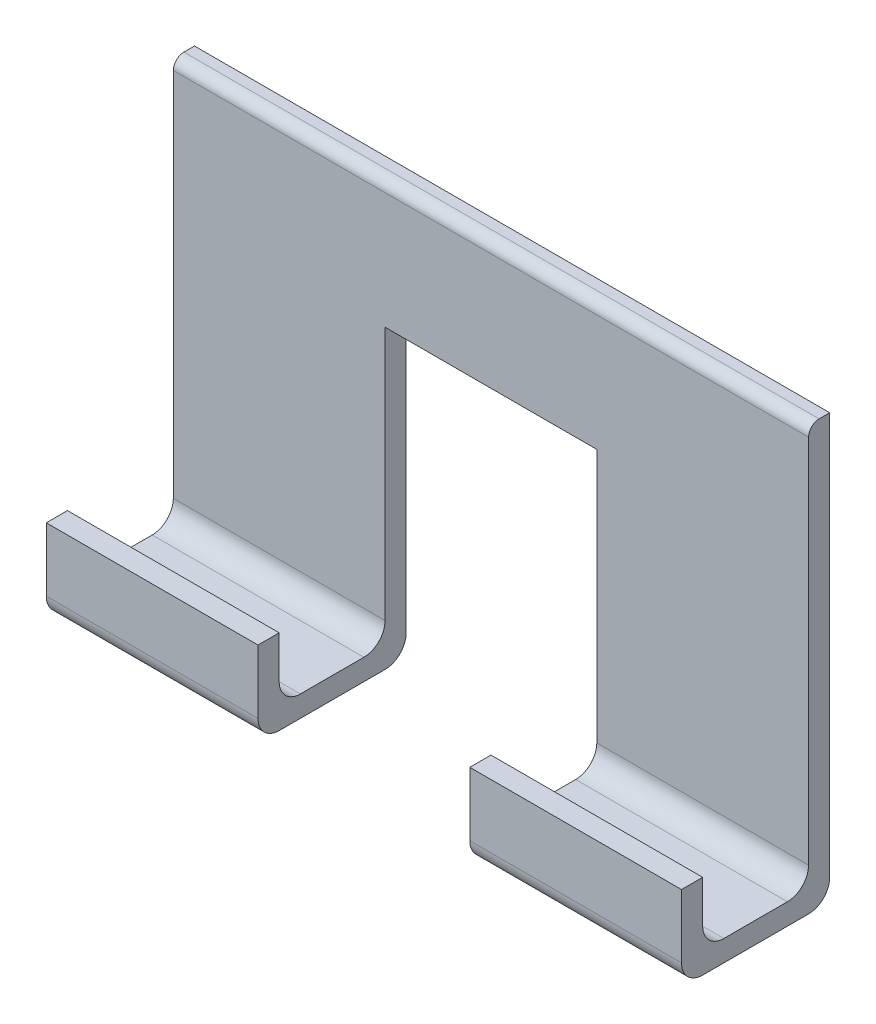
ISO-10303-21;
HEADER;
FILE_DESCRIPTION(('STEP AP214'),'2;1');
FILE_NAME('part.step','',(''),(''),'','','');
FILE_SCHEMA(('AUTOMOTIVE_DESIGN { 1 0 10303 214 1 1 1 1 }'));
ENDSEC;
DATA;
#1=APPLICATION_CONTEXT('core data for automotive mechanical design processes');
#2=APPLICATION_PROTOCOL_DEFINITION('international standard','automotive_design',2000,#1);
#3=PRODUCT_CONTEXT('',#1,'mechanical');
#4=PRODUCT('Part','Part','',(#3));
#5=PRODUCT_RELATED_PRODUCT_CATEGORY('part','',(#4));
#6=PRODUCT_DEFINITION_FORMATION('','',#4);
#7=PRODUCT_DEFINITION_CONTEXT('part definition',#1,'design');
#8=PRODUCT_DEFINITION('design','',#6,#7);
#9=PRODUCT_DEFINITION_SHAPE('','',#8);
#10=(LENGTH_UNIT() NAMED_UNIT(*) SI_UNIT(.MILLI.,.METRE.));
#11=(NAMED_UNIT(*) PLANE_ANGLE_UNIT() SI_UNIT($,.RADIAN.));
#12=(NAMED_UNIT(*) SI_UNIT($,.STERADIAN.) SOLID_ANGLE_UNIT());
#13=UNCERTAINTY_MEASURE_WITH_UNIT(LENGTH_MEASURE(1.E-05),#10,'distance_accuracy_value','');
#14=(GEOMETRIC_REPRESENTATION_CONTEXT(3) GLOBAL_UNCERTAINTY_ASSIGNED_CONTEXT((#13)) GLOBAL_UNIT_ASSIGNED_CONTEXT((#10,
#11,#12)) REPRESENTATION_CONTEXT('',''));
#15=CARTESIAN_POINT('',(0.,0.,0.));
#16=DIRECTION('',(0.,0.,1.));
#17=DIRECTION('',(1.,0.,0.));
#18=AXIS2_PLACEMENT_3D('',#15,#16,#17);
#19=CARTESIAN_POINT('',(150.,10.,60.));
#20=DIRECTION('',(0.,-1.,0.));
#21=DIRECTION('',(0.,0.,-1.));
#22=AXIS2_PLACEMENT_3D('',#19,#20,#21);
#23=PLANE('',#22);
#24=DIRECTION('',(0.,0.,-1.));
#25=VECTOR('',#24,1.);
#26=CARTESIAN_POINT('',(-50.,10.,60.));
#27=LINE('',#26,#25);
#28=CARTESIAN_POINT('',(-50.,10.,50.));
#29=VERTEX_POINT('',#28);
#30=CARTESIAN_POINT('',(-50.,10.,20.));
#31=VERTEX_POINT('',#30);
#32=EDGE_CURVE('E275',#29,#31,#27,.T.);
#33=ORIENTED_EDGE('',*,*,#32,.T.);
#34=DIRECTION('',(-1.,0.,0.));
#35=VECTOR('',#34,1.);
#36=CARTESIAN_POINT('',(-150.,10.,20.));
#37=LINE('',#36,#35);
#38=CARTESIAN_POINT('',(-150.,10.,20.));
#39=VERTEX_POINT('',#38);
#40=EDGE_CURVE('E429',#31,#39,#37,.T.);
#41=ORIENTED_EDGE('',*,*,#40,.T.);
#42=DIRECTION('',(0.,0.,1.));
#43=VECTOR('',#42,1.);
#44=CARTESIAN_POINT('',(-150.,10.,60.));
#45=LINE('',#44,#43);
#46=CARTESIAN_POINT('',(-150.,10.,50.));
#47=VERTEX_POINT('',#46);
#48=EDGE_CURVE('E320',#39,#47,#45,.T.);
#49=ORIENTED_EDGE('',*,*,#48,.T.);
#50=DIRECTION('',(-1.,0.,0.));
#51=VECTOR('',#50,1.);
#52=CARTESIAN_POINT('',(-50.,10.,50.));
#53=LINE('',#52,#51);
#54=EDGE_CURVE('E426',#47,#29,#53,.F.);
#55=ORIENTED_EDGE('',*,*,#54,.T.);
#56=EDGE_LOOP('',(#33,#41,#49,#55));
#57=FACE_BOUND('',#56,.T.);
#58=ADVANCED_FACE('F45',(#57),#23,.F.);
#59=CARTESIAN_POINT('',(150.,10.,60.));
#60=DIRECTION('',(0.,0.,1.));
#61=DIRECTION('',(0.,-1.,0.));
#62=AXIS2_PLACEMENT_3D('',#59,#60,#61);
#63=PLANE('',#62);
#64=DIRECTION('',(0.,-1.,0.));
#65=VECTOR('',#64,1.);
#66=CARTESIAN_POINT('',(-50.,10.,60.));
#67=LINE('',#66,#65);
#68=CARTESIAN_POINT('',(-50.,40.,60.));
#69=VERTEX_POINT('',#68);
#70=CARTESIAN_POINT('',(-50.,20.,60.));
#71=VERTEX_POINT('',#70);
#72=EDGE_CURVE('E271',#69,#71,#67,.T.);
#73=ORIENTED_EDGE('',*,*,#72,.T.);
#74=DIRECTION('',(-1.,0.,0.));
#75=VECTOR('',#74,1.);
#76=CARTESIAN_POINT('',(-150.,20.,60.));
#77=LINE('',#76,#75);
#78=CARTESIAN_POINT('',(-150.,20.,60.));
#79=VERTEX_POINT('',#78);
#80=EDGE_CURVE('E437',#71,#79,#77,.T.);
#81=ORIENTED_EDGE('',*,*,#80,.T.);
#82=DIRECTION('',(0.,1.,0.));
#83=VECTOR('',#82,1.);
#84=CARTESIAN_POINT('',(-150.,10.,60.));
#85=LINE('',#84,#83);
#86=CARTESIAN_POINT('',(-150.,40.,60.));
#87=VERTEX_POINT('',#86);
#88=EDGE_CURVE('E324',#79,#87,#85,.T.);
#89=ORIENTED_EDGE('',*,*,#88,.T.);
#90=DIRECTION('',(-1.,0.,0.));
#91=VECTOR('',#90,1.);
#92=CARTESIAN_POINT('',(150.,40.,60.));
#93=LINE('',#92,#91);
#94=EDGE_CURVE('E342',#69,#87,#93,.T.);
#95=ORIENTED_EDGE('',*,*,#94,.F.);
#96=EDGE_LOOP('',(#73,#81,#89,#95));
#97=FACE_BOUND('',#96,.T.);
#98=ADVANCED_FACE('F567',(#97),#63,.F.);
#99=CARTESIAN_POINT('',(150.,40.,70.));
#100=DIRECTION('',(0.,-1.,0.));
#101=DIRECTION('',(0.,0.,-1.));
#102=AXIS2_PLACEMENT_3D('',#99,#100,#101);
#103=PLANE('',#102);
#104=DIRECTION('',(-1.,0.,0.));
#105=VECTOR('',#104,1.);
#106=CARTESIAN_POINT('',(150.,40.,70.));
#107=LINE('',#106,#105);
#108=CARTESIAN_POINT('',(-50.,40.,70.));
#109=VERTEX_POINT('',#108);
#110=CARTESIAN_POINT('',(-150.,40.,70.));
#111=VERTEX_POINT('',#110);
#112=EDGE_CURVE('E311',#109,#111,#107,.T.);
#113=ORIENTED_EDGE('',*,*,#112,.F.);
#114=DIRECTION('',(0.,0.,-1.));
#115=VECTOR('',#114,1.);
#116=CARTESIAN_POINT('',(-50.,40.,70.));
#117=LINE('',#116,#115);
#118=EDGE_CURVE('E267',#109,#69,#117,.T.);
#119=ORIENTED_EDGE('',*,*,#118,.T.);
#120=ORIENTED_EDGE('',*,*,#94,.T.);
#121=DIRECTION('',(0.,0.,1.));
#122=VECTOR('',#121,1.);
#123=CARTESIAN_POINT('',(-150.,40.,70.));
#124=LINE('',#123,#122);
#125=EDGE_CURVE('E327',#87,#111,#124,.T.);
#126=ORIENTED_EDGE('',*,*,#125,.T.);
#127=EDGE_LOOP('',(#113,#119,#120,#126));
#128=FACE_BOUND('',#127,.T.);
#129=ADVANCED_FACE('F483',(#128),#103,.F.);
#130=CARTESIAN_POINT('',(150.,40.,70.));
#131=DIRECTION('',(0.,0.,-1.));
#132=DIRECTION('',(-1.,0.,0.));
#133=AXIS2_PLACEMENT_3D('',#130,#131,#132);
#134=PLANE('',#133);
#135=DIRECTION('',(0.,-1.,0.));
#136=VECTOR('',#135,1.);
#137=CARTESIAN_POINT('',(-150.,40.,70.));
#138=LINE('',#137,#136);
#139=CARTESIAN_POINT('',(-150.,10.,70.));
#140=VERTEX_POINT('',#139);
#141=EDGE_CURVE('E331',#111,#140,#138,.T.);
#142=ORIENTED_EDGE('',*,*,#141,.T.);
#143=DIRECTION('',(-1.,0.,0.));
#144=VECTOR('',#143,1.);
#145=CARTESIAN_POINT('',(150.,10.,70.));
#146=LINE('',#145,#144);
#147=CARTESIAN_POINT('',(-50.,10.,70.));
#148=VERTEX_POINT('',#147);
#149=EDGE_CURVE('E406',#140,#148,#146,.F.);
#150=ORIENTED_EDGE('',*,*,#149,.T.);
#151=DIRECTION('',(0.,-1.,0.));
#152=VECTOR('',#151,1.);
#153=CARTESIAN_POINT('',(-50.,-140.,70.));
#154=LINE('',#153,#152);
#155=EDGE_CURVE('E245',#109,#148,#154,.T.);
#156=ORIENTED_EDGE('',*,*,#155,.F.);
#157=ORIENTED_EDGE('',*,*,#112,.T.);
#158=EDGE_LOOP('',(#142,#150,#156,#157));
#159=FACE_BOUND('',#158,.T.);
#160=ADVANCED_FACE('F478',(#159),#134,.F.);
#161=CARTESIAN_POINT('',(150.,0.,0.));
#162=DIRECTION('',(0.,1.,0.));
#163=DIRECTION('',(0.,0.,1.));
#164=AXIS2_PLACEMENT_3D('',#161,#162,#163);
#165=PLANE('',#164);
#166=DIRECTION('',(0.,0.,-1.));
#167=VECTOR('',#166,1.);
#168=CARTESIAN_POINT('',(-150.,0.,0.));
#169=LINE('',#168,#167);
#170=CARTESIAN_POINT('',(-150.,0.,60.));
#171=VERTEX_POINT('',#170);
#172=CARTESIAN_POINT('',(-150.,0.,10.));
#173=VERTEX_POINT('',#172);
#174=EDGE_CURVE('E287',#171,#173,#169,.T.);
#175=ORIENTED_EDGE('',*,*,#174,.T.);
#176=DIRECTION('',(-1.,0.,0.));
#177=VECTOR('',#176,1.);
#178=CARTESIAN_POINT('',(150.,0.,10.));
#179=LINE('',#178,#177);
#180=CARTESIAN_POINT('',(-50.,0.,10.));
#181=VERTEX_POINT('',#180);
#182=EDGE_CURVE('E378',#173,#181,#179,.F.);
#183=ORIENTED_EDGE('',*,*,#182,.T.);
#184=DIRECTION('',(0.,0.,1.));
#185=VECTOR('',#184,1.);
#186=CARTESIAN_POINT('',(-50.,0.,0.));
#187=LINE('',#186,#185);
#188=CARTESIAN_POINT('',(-50.,0.,60.));
#189=VERTEX_POINT('',#188);
#190=EDGE_CURVE('E355',#181,#189,#187,.T.);
#191=ORIENTED_EDGE('',*,*,#190,.T.);
#192=DIRECTION('',(-1.,0.,0.));
#193=VECTOR('',#192,1.);
#194=CARTESIAN_POINT('',(150.,0.,60.));
#195=LINE('',#194,#193);
#196=EDGE_CURVE('E374',#189,#171,#195,.T.);
#197=ORIENTED_EDGE('',*,*,#196,.T.);
#198=EDGE_LOOP('',(#175,#183,#191,#197));
#199=FACE_BOUND('',#198,.T.);
#200=ADVANCED_FACE('F493',(#199),#165,.F.);
#201=CARTESIAN_POINT('',(150.,0.,0.));
#202=DIRECTION('',(0.,0.,1.));
#203=DIRECTION('',(1.,0.,0.));
#204=AXIS2_PLACEMENT_3D('',#201,#202,#203);
#205=PLANE('',#204);
#206=DIRECTION('',(0.,-1.,0.));
#207=VECTOR('',#206,1.);
#208=CARTESIAN_POINT('',(-50.,-140.,0.));
#209=LINE('',#208,#207);
#210=CARTESIAN_POINT('',(-50.,140.,0.));
#211=VERTEX_POINT('',#210);
#212=CARTESIAN_POINT('',(-50.,10.,0.));
#213=VERTEX_POINT('',#212);
#214=EDGE_CURVE('E225',#211,#213,#209,.T.);
#215=ORIENTED_EDGE('',*,*,#214,.T.);
#216=DIRECTION('',(-1.,0.,0.));
#217=VECTOR('',#216,1.);
#218=CARTESIAN_POINT('',(150.,10.,0.));
#219=LINE('',#218,#217);
#220=CARTESIAN_POINT('',(-150.,10.,0.));
#221=VERTEX_POINT('',#220);
#222=EDGE_CURVE('E364',#213,#221,#219,.T.);
#223=ORIENTED_EDGE('',*,*,#222,.T.);
#224=DIRECTION('',(0.,1.,0.));
#225=VECTOR('',#224,1.);
#226=CARTESIAN_POINT('',(-150.,0.,0.));
#227=LINE('',#226,#225);
#228=CARTESIAN_POINT('',(-150.,200.,0.));
#229=VERTEX_POINT('',#228);
#230=EDGE_CURVE('E282',#221,#229,#227,.T.);
#231=ORIENTED_EDGE('',*,*,#230,.T.);
#232=DIRECTION('',(-1.,0.,0.));
#233=VECTOR('',#232,1.);
#234=CARTESIAN_POINT('',(150.,200.,0.));
#235=LINE('',#234,#233);
#236=CARTESIAN_POINT('',(150.,200.,0.));
#237=VERTEX_POINT('',#236);
#238=EDGE_CURVE('E347',#237,#229,#235,.T.);
#239=ORIENTED_EDGE('',*,*,#238,.F.);
#240=DIRECTION('',(0.,1.,0.));
#241=VECTOR('',#240,1.);
#242=CARTESIAN_POINT('',(150.,0.,0.));
#243=LINE('',#242,#241);
#244=CARTESIAN_POINT('',(150.,10.,0.));
#245=VERTEX_POINT('',#244);
#246=EDGE_CURVE('E283',#245,#237,#243,.T.);
#247=ORIENTED_EDGE('',*,*,#246,.F.);
#248=DIRECTION('',(-1.,0.,0.));
#249=VECTOR('',#248,1.);
#250=CARTESIAN_POINT('',(150.,10.,0.));
#251=LINE('',#250,#249);
#252=CARTESIAN_POINT('',(50.,10.,0.));
#253=VERTEX_POINT('',#252);
#254=EDGE_CURVE('E222',#245,#253,#251,.T.);
#255=ORIENTED_EDGE('',*,*,#254,.T.);
#256=DIRECTION('',(0.,1.,0.));
#257=VECTOR('',#256,1.);
#258=CARTESIAN_POINT('',(50.,-140.,0.));
#259=LINE('',#258,#257);
#260=CARTESIAN_POINT('',(50.,140.,0.));
#261=VERTEX_POINT('',#260);
#262=EDGE_CURVE('E214',#253,#261,#259,.T.);
#263=ORIENTED_EDGE('',*,*,#262,.T.);
#264=DIRECTION('',(-1.,0.,0.));
#265=VECTOR('',#264,1.);
#266=CARTESIAN_POINT('',(50.,140.,0.));
#267=LINE('',#266,#265);
#268=EDGE_CURVE('E219',#261,#211,#267,.T.);
#269=ORIENTED_EDGE('',*,*,#268,.T.);
#270=EDGE_LOOP('',(#215,#223,#231,#239,#247,#255,#263,#269));
#271=FACE_BOUND('',#270,.T.);
#272=ADVANCED_FACE('F217',(#271),#205,.F.);
#273=CARTESIAN_POINT('',(150.,200.,0.));
#274=DIRECTION('',(0.,-1.,0.));
#275=DIRECTION('',(0.,0.,-1.));
#276=AXIS2_PLACEMENT_3D('',#273,#274,#275);
#277=PLANE('',#276);
#278=DIRECTION('',(0.,0.,1.));
#279=VECTOR('',#278,1.);
#280=CARTESIAN_POINT('',(-150.,200.,0.));
#281=LINE('',#280,#279);
#282=CARTESIAN_POINT('',(-150.,200.,5.));
#283=VERTEX_POINT('',#282);
#284=EDGE_CURVE('E314',#229,#283,#281,.T.);
#285=ORIENTED_EDGE('',*,*,#284,.T.);
#286=DIRECTION('',(-1.,0.,0.));
#287=VECTOR('',#286,1.);
#288=CARTESIAN_POINT('',(150.,200.,5.));
#289=LINE('',#288,#287);
#290=CARTESIAN_POINT('',(150.,200.,5.));
#291=VERTEX_POINT('',#290);
#292=EDGE_CURVE('E54',#283,#291,#289,.F.);
#293=ORIENTED_EDGE('',*,*,#292,.T.);
#294=DIRECTION('',(0.,0.,1.));
#295=VECTOR('',#294,1.);
#296=CARTESIAN_POINT('',(150.,200.,0.));
#297=LINE('',#296,#295);
#298=EDGE_CURVE('E286',#237,#291,#297,.T.);
#299=ORIENTED_EDGE('',*,*,#298,.F.);
#300=ORIENTED_EDGE('',*,*,#238,.T.);
#301=EDGE_LOOP('',(#285,#293,#299,#300));
#302=FACE_BOUND('',#301,.T.);
#303=ADVANCED_FACE('F504',(#302),#277,.F.);
#304=CARTESIAN_POINT('',(150.,200.,10.));
#305=DIRECTION('',(0.,0.,-1.));
#306=DIRECTION('',(0.,1.,0.));
#307=AXIS2_PLACEMENT_3D('',#304,#305,#306);
#308=PLANE('',#307);
#309=DIRECTION('',(0.,-1.,0.));
#310=VECTOR('',#309,1.);
#311=CARTESIAN_POINT('',(150.,200.,10.));
#312=LINE('',#311,#310);
#313=CARTESIAN_POINT('',(150.,195.,10.));
#314=VERTEX_POINT('',#313);
#315=CARTESIAN_POINT('',(150.,20.,9.99999999999999));
#316=VERTEX_POINT('',#315);
#317=EDGE_CURVE('E290',#314,#316,#312,.T.);
#318=ORIENTED_EDGE('',*,*,#317,.F.);
#319=DIRECTION('',(-1.,0.,0.));
#320=VECTOR('',#319,1.);
#321=CARTESIAN_POINT('',(150.,195.,10.));
#322=LINE('',#321,#320);
#323=CARTESIAN_POINT('',(-150.,195.,10.));
#324=VERTEX_POINT('',#323);
#325=EDGE_CURVE('E466',#314,#324,#322,.T.);
#326=ORIENTED_EDGE('',*,*,#325,.T.);
#327=DIRECTION('',(0.,-1.,0.));
#328=VECTOR('',#327,1.);
#329=CARTESIAN_POINT('',(-150.,200.,10.));
#330=LINE('',#329,#328);
#331=CARTESIAN_POINT('',(-150.,20.,9.99999999999999));
#332=VERTEX_POINT('',#331);
#333=EDGE_CURVE('E317',#324,#332,#330,.T.);
#334=ORIENTED_EDGE('',*,*,#333,.T.);
#335=DIRECTION('',(-1.,0.,0.));
#336=VECTOR('',#335,1.);
#337=CARTESIAN_POINT('',(-50.,20.,9.99999999999999));
#338=LINE('',#337,#336);
#339=CARTESIAN_POINT('',(-50.,20.,9.99999999999999));
#340=VERTEX_POINT('',#339);
#341=EDGE_CURVE('E419',#332,#340,#338,.F.);
#342=ORIENTED_EDGE('',*,*,#341,.T.);
#343=DIRECTION('',(0.,1.,0.));
#344=VECTOR('',#343,1.);
#345=CARTESIAN_POINT('',(-50.,200.,10.));
#346=LINE('',#345,#344);
#347=CARTESIAN_POINT('',(-50.,140.,10.));
#348=VERTEX_POINT('',#347);
#349=EDGE_CURVE('E279',#340,#348,#346,.T.);
#350=ORIENTED_EDGE('',*,*,#349,.T.);
#351=DIRECTION('',(1.,0.,0.));
#352=VECTOR('',#351,1.);
#353=CARTESIAN_POINT('',(150.,140.,10.));
#354=LINE('',#353,#352);
#355=CARTESIAN_POINT('',(50.,140.,9.99999999999999));
#356=VERTEX_POINT('',#355);
#357=EDGE_CURVE('E359',#348,#356,#354,.T.);
#358=ORIENTED_EDGE('',*,*,#357,.T.);
#359=DIRECTION('',(0.,-1.,0.));
#360=VECTOR('',#359,1.);
#361=CARTESIAN_POINT('',(50.,200.,10.));
#362=LINE('',#361,#360);
#363=CARTESIAN_POINT('',(50.,20.,9.99999999999999));
#364=VERTEX_POINT('',#363);
#365=EDGE_CURVE('E231',#356,#364,#362,.T.);
#366=ORIENTED_EDGE('',*,*,#365,.T.);
#367=DIRECTION('',(-1.,0.,0.));
#368=VECTOR('',#367,1.);
#369=CARTESIAN_POINT('',(150.,20.,9.99999999999999));
#370=LINE('',#369,#368);
#371=EDGE_CURVE('E422',#364,#316,#370,.F.);
#372=ORIENTED_EDGE('',*,*,#371,.T.);
#373=EDGE_LOOP('',(#318,#326,#334,#342,#350,#358,#366,#372));
#374=FACE_BOUND('',#373,.T.);
#375=ADVANCED_FACE('F550',(#374),#308,.F.);
#376=DIRECTION('',(0.,0.,1.));
#377=VECTOR('',#376,1.);
#378=CARTESIAN_POINT('',(150.,10.,60.));
#379=LINE('',#378,#377);
#380=CARTESIAN_POINT('',(150.,10.,20.));
#381=VERTEX_POINT('',#380);
#382=CARTESIAN_POINT('',(150.,10.,50.));
#383=VERTEX_POINT('',#382);
#384=EDGE_CURVE('E293',#381,#383,#379,.T.);
#385=ORIENTED_EDGE('',*,*,#384,.F.);
#386=DIRECTION('',(-1.,0.,0.));
#387=VECTOR('',#386,1.);
#388=CARTESIAN_POINT('',(50.,10.,20.));
#389=LINE('',#388,#387);
#390=CARTESIAN_POINT('',(50.,10.,20.));
#391=VERTEX_POINT('',#390);
#392=EDGE_CURVE('E415',#381,#391,#389,.T.);
#393=ORIENTED_EDGE('',*,*,#392,.T.);
#394=DIRECTION('',(0.,0.,1.));
#395=VECTOR('',#394,1.);
#396=CARTESIAN_POINT('',(50.,10.,60.));
#397=LINE('',#396,#395);
#398=CARTESIAN_POINT('',(50.,10.,50.));
#399=VERTEX_POINT('',#398);
#400=EDGE_CURVE('E261',#391,#399,#397,.T.);
#401=ORIENTED_EDGE('',*,*,#400,.T.);
#402=DIRECTION('',(-1.,0.,0.));
#403=VECTOR('',#402,1.);
#404=CARTESIAN_POINT('',(150.,10.,50.));
#405=LINE('',#404,#403);
#406=EDGE_CURVE('E412',#399,#383,#405,.F.);
#407=ORIENTED_EDGE('',*,*,#406,.T.);
#408=EDGE_LOOP('',(#385,#393,#401,#407));
#409=FACE_BOUND('',#408,.T.);
#410=ADVANCED_FACE('F541',(#409),#23,.F.);
#411=DIRECTION('',(0.,1.,0.));
#412=VECTOR('',#411,1.);
#413=CARTESIAN_POINT('',(150.,10.,60.));
#414=LINE('',#413,#412);
#415=CARTESIAN_POINT('',(150.,20.,60.));
#416=VERTEX_POINT('',#415);
#417=CARTESIAN_POINT('',(150.,40.,60.));
#418=VERTEX_POINT('',#417);
#419=EDGE_CURVE('E297',#416,#418,#414,.T.);
#420=ORIENTED_EDGE('',*,*,#419,.F.);
#421=DIRECTION('',(-1.,0.,0.));
#422=VECTOR('',#421,1.);
#423=CARTESIAN_POINT('',(50.,20.,60.));
#424=LINE('',#423,#422);
#425=CARTESIAN_POINT('',(50.,20.,60.));
#426=VERTEX_POINT('',#425);
#427=EDGE_CURVE('E433',#416,#426,#424,.T.);
#428=ORIENTED_EDGE('',*,*,#427,.T.);
#429=DIRECTION('',(0.,1.,0.));
#430=VECTOR('',#429,1.);
#431=CARTESIAN_POINT('',(50.,10.,60.));
#432=LINE('',#431,#430);
#433=CARTESIAN_POINT('',(50.,40.,60.));
#434=VERTEX_POINT('',#433);
#435=EDGE_CURVE('E258',#426,#434,#432,.T.);
#436=ORIENTED_EDGE('',*,*,#435,.T.);
#437=EDGE_CURVE('E343',#418,#434,#93,.T.);
#438=ORIENTED_EDGE('',*,*,#437,.F.);
#439=EDGE_LOOP('',(#420,#428,#436,#438));
#440=FACE_BOUND('',#439,.T.);
#441=ADVANCED_FACE('F533',(#440),#63,.F.);
#442=ORIENTED_EDGE('',*,*,#437,.T.);
#443=DIRECTION('',(0.,0.,1.));
#444=VECTOR('',#443,1.);
#445=CARTESIAN_POINT('',(50.,40.,70.));
#446=LINE('',#445,#444);
#447=CARTESIAN_POINT('',(50.,40.,70.));
#448=VERTEX_POINT('',#447);
#449=EDGE_CURVE('E253',#434,#448,#446,.T.);
#450=ORIENTED_EDGE('',*,*,#449,.T.);
#451=CARTESIAN_POINT('',(150.,40.,70.));
#452=VERTEX_POINT('',#451);
#453=EDGE_CURVE('E338',#452,#448,#107,.T.);
#454=ORIENTED_EDGE('',*,*,#453,.F.);
#455=DIRECTION('',(0.,0.,1.));
#456=VECTOR('',#455,1.);
#457=CARTESIAN_POINT('',(150.,40.,70.));
#458=LINE('',#457,#456);
#459=EDGE_CURVE('E300',#418,#452,#458,.T.);
#460=ORIENTED_EDGE('',*,*,#459,.F.);
#461=EDGE_LOOP('',(#442,#450,#454,#460));
#462=FACE_BOUND('',#461,.T.);
#463=ADVANCED_FACE('F527',(#462),#103,.F.);
#464=DIRECTION('',(0.,1.,0.));
#465=VECTOR('',#464,1.);
#466=CARTESIAN_POINT('',(50.,-140.,70.));
#467=LINE('',#466,#465);
#468=CARTESIAN_POINT('',(50.,10.,70.));
#469=VERTEX_POINT('',#468);
#470=EDGE_CURVE('E249',#469,#448,#467,.T.);
#471=ORIENTED_EDGE('',*,*,#470,.F.);
#472=DIRECTION('',(-1.,0.,0.));
#473=VECTOR('',#472,1.);
#474=CARTESIAN_POINT('',(150.,10.,70.));
#475=LINE('',#474,#473);
#476=CARTESIAN_POINT('',(150.,10.,70.));
#477=VERTEX_POINT('',#476);
#478=EDGE_CURVE('E409',#469,#477,#475,.F.);
#479=ORIENTED_EDGE('',*,*,#478,.T.);
#480=DIRECTION('',(0.,-1.,0.));
#481=VECTOR('',#480,1.);
#482=CARTESIAN_POINT('',(150.,40.,70.));
#483=LINE('',#482,#481);
#484=EDGE_CURVE('E303',#452,#477,#483,.T.);
#485=ORIENTED_EDGE('',*,*,#484,.F.);
#486=ORIENTED_EDGE('',*,*,#453,.T.);
#487=EDGE_LOOP('',(#471,#479,#485,#486));
#488=FACE_BOUND('',#487,.T.);
#489=ADVANCED_FACE('F522',(#488),#134,.F.);
#490=DIRECTION('',(0.,0.,-1.));
#491=VECTOR('',#490,1.);
#492=CARTESIAN_POINT('',(50.,0.,0.));
#493=LINE('',#492,#491);
#494=CARTESIAN_POINT('',(50.,0.,60.));
#495=VERTEX_POINT('',#494);
#496=CARTESIAN_POINT('',(50.,0.,10.));
#497=VERTEX_POINT('',#496);
#498=EDGE_CURVE('E351',#495,#497,#493,.T.);
#499=ORIENTED_EDGE('',*,*,#498,.T.);
#500=DIRECTION('',(-1.,0.,0.));
#501=VECTOR('',#500,1.);
#502=CARTESIAN_POINT('',(150.,0.,10.));
#503=LINE('',#502,#501);
#504=CARTESIAN_POINT('',(150.,0.,10.));
#505=VERTEX_POINT('',#504);
#506=EDGE_CURVE('E397',#497,#505,#503,.F.);
#507=ORIENTED_EDGE('',*,*,#506,.T.);
#508=DIRECTION('',(0.,0.,-1.));
#509=VECTOR('',#508,1.);
#510=CARTESIAN_POINT('',(150.,0.,26.));
#511=LINE('',#510,#509);
#512=CARTESIAN_POINT('',(150.,0.,60.));
#513=VERTEX_POINT('',#512);
#514=EDGE_CURVE('E307',#513,#505,#511,.T.);
#515=ORIENTED_EDGE('',*,*,#514,.F.);
#516=DIRECTION('',(-1.,0.,0.));
#517=VECTOR('',#516,1.);
#518=CARTESIAN_POINT('',(150.,0.,60.));
#519=LINE('',#518,#517);
#520=EDGE_CURVE('E393',#513,#495,#519,.T.);
#521=ORIENTED_EDGE('',*,*,#520,.T.);
#522=EDGE_LOOP('',(#499,#507,#515,#521));
#523=FACE_BOUND('',#522,.T.);
#524=ADVANCED_FACE('F512',(#523),#165,.F.);
#525=CARTESIAN_POINT('',(150.,0.,0.));
#526=DIRECTION('',(1.,0.,0.));
#527=DIRECTION('',(0.,0.,-1.));
#528=AXIS2_PLACEMENT_3D('',#525,#526,#527);
#529=PLANE('',#528);
#530=ORIENTED_EDGE('',*,*,#298,.T.);
#531=CARTESIAN_POINT('',(150.,195.,5.));
#532=DIRECTION('',(1.,0.,0.));
#533=DIRECTION('',(0.,0.,-1.));
#534=AXIS2_PLACEMENT_3D('',#531,#532,#533);
#535=CIRCLE('',#534,5.);
#536=EDGE_CURVE('E11',#291,#314,#535,.T.);
#537=ORIENTED_EDGE('',*,*,#536,.T.);
#538=ORIENTED_EDGE('',*,*,#317,.T.);
#539=CARTESIAN_POINT('',(150.,20.,20.));
#540=DIRECTION('',(1.,0.,0.));
#541=DIRECTION('',(0.,0.,-1.));
#542=AXIS2_PLACEMENT_3D('',#539,#540,#541);
#543=CIRCLE('',#542,10.);
#544=EDGE_CURVE('E444',#316,#381,#543,.F.);
#545=ORIENTED_EDGE('',*,*,#544,.T.);
#546=ORIENTED_EDGE('',*,*,#384,.T.);
#547=CARTESIAN_POINT('',(150.,20.,50.));
#548=DIRECTION('',(1.,0.,0.));
#549=DIRECTION('',(0.,0.,-1.));
#550=AXIS2_PLACEMENT_3D('',#547,#548,#549);
#551=CIRCLE('',#550,10.);
#552=EDGE_CURVE('E457',#383,#416,#551,.F.);
#553=ORIENTED_EDGE('',*,*,#552,.T.);
#554=ORIENTED_EDGE('',*,*,#419,.T.);
#555=ORIENTED_EDGE('',*,*,#459,.T.);
#556=ORIENTED_EDGE('',*,*,#484,.T.);
#557=CARTESIAN_POINT('',(150.,10.,60.));
#558=DIRECTION('',(1.,0.,0.));
#559=DIRECTION('',(0.,0.,-1.));
#560=AXIS2_PLACEMENT_3D('',#557,#558,#559);
#561=CIRCLE('',#560,10.);
#562=EDGE_CURVE('E400',#477,#513,#561,.T.);
#563=ORIENTED_EDGE('',*,*,#562,.T.);
#564=ORIENTED_EDGE('',*,*,#514,.T.);
#565=CARTESIAN_POINT('',(150.,10.,10.));
#566=DIRECTION('',(1.,0.,0.));
#567=DIRECTION('',(0.,0.,-1.));
#568=AXIS2_PLACEMENT_3D('',#565,#566,#567);
#569=CIRCLE('',#568,10.);
#570=EDGE_CURVE('E403',#505,#245,#569,.T.);
#571=ORIENTED_EDGE('',*,*,#570,.T.);
#572=ORIENTED_EDGE('',*,*,#246,.T.);
#573=EDGE_LOOP('',(#530,#537,#538,#545,#546,#553,#554,#555,#556,#563,#564,#571,#572));
#574=FACE_BOUND('',#573,.T.);
#575=ADVANCED_FACE('F543',(#574),#529,.T.);
#576=CARTESIAN_POINT('',(-150.,0.,0.));
#577=DIRECTION('',(1.,0.,0.));
#578=DIRECTION('',(0.,0.,-1.));
#579=AXIS2_PLACEMENT_3D('',#576,#577,#578);
#580=PLANE('',#579);
#581=ORIENTED_EDGE('',*,*,#333,.F.);
#582=CARTESIAN_POINT('',(-150.,195.,5.));
#583=DIRECTION('',(1.,0.,0.));
#584=DIRECTION('',(0.,0.,-1.));
#585=AXIS2_PLACEMENT_3D('',#582,#583,#584);
#586=CIRCLE('',#585,5.);
#587=EDGE_CURVE('E68',#324,#283,#586,.F.);
#588=ORIENTED_EDGE('',*,*,#587,.T.);
#589=ORIENTED_EDGE('',*,*,#284,.F.);
#590=ORIENTED_EDGE('',*,*,#230,.F.);
#591=CARTESIAN_POINT('',(-150.,10.,10.));
#592=DIRECTION('',(1.,0.,0.));
#593=DIRECTION('',(0.,0.,-1.));
#594=AXIS2_PLACEMENT_3D('',#591,#592,#593);
#595=CIRCLE('',#594,10.);
#596=EDGE_CURVE('E371',#221,#173,#595,.F.);
#597=ORIENTED_EDGE('',*,*,#596,.T.);
#598=ORIENTED_EDGE('',*,*,#174,.F.);
#599=CARTESIAN_POINT('',(-150.,10.,60.));
#600=DIRECTION('',(1.,0.,0.));
#601=DIRECTION('',(0.,0.,-1.));
#602=AXIS2_PLACEMENT_3D('',#599,#600,#601);
#603=CIRCLE('',#602,10.);
#604=EDGE_CURVE('E368',#171,#140,#603,.F.);
#605=ORIENTED_EDGE('',*,*,#604,.T.);
#606=ORIENTED_EDGE('',*,*,#141,.F.);
#607=ORIENTED_EDGE('',*,*,#125,.F.);
#608=ORIENTED_EDGE('',*,*,#88,.F.);
#609=CARTESIAN_POINT('',(-150.,20.,50.));
#610=DIRECTION('',(1.,0.,0.));
#611=DIRECTION('',(0.,0.,-1.));
#612=AXIS2_PLACEMENT_3D('',#609,#610,#611);
#613=CIRCLE('',#612,10.);
#614=EDGE_CURVE('E460',#79,#47,#613,.T.);
#615=ORIENTED_EDGE('',*,*,#614,.T.);
#616=ORIENTED_EDGE('',*,*,#48,.F.);
#617=CARTESIAN_POINT('',(-150.,20.,20.));
#618=DIRECTION('',(1.,0.,0.));
#619=DIRECTION('',(0.,0.,-1.));
#620=AXIS2_PLACEMENT_3D('',#617,#618,#619);
#621=CIRCLE('',#620,10.);
#622=EDGE_CURVE('E447',#39,#332,#621,.T.);
#623=ORIENTED_EDGE('',*,*,#622,.T.);
#624=EDGE_LOOP('',(#581,#588,#589,#590,#597,#598,#605,#606,#607,#608,#615,#616,#623));
#625=FACE_BOUND('',#624,.T.);
#626=ADVANCED_FACE('F486',(#625),#580,.F.);
#627=CARTESIAN_POINT('',(50.,140.,0.));
#628=DIRECTION('',(0.,1.,0.));
#629=DIRECTION('',(0.,0.,1.));
#630=AXIS2_PLACEMENT_3D('',#627,#628,#629);
#631=PLANE('',#630);
#632=DIRECTION('',(0.,0.,1.));
#633=VECTOR('',#632,1.);
#634=CARTESIAN_POINT('',(-50.,140.,0.));
#635=LINE('',#634,#633);
#636=EDGE_CURVE('E236',#211,#348,#635,.T.);
#637=ORIENTED_EDGE('',*,*,#636,.F.);
#638=ORIENTED_EDGE('',*,*,#268,.F.);
#639=DIRECTION('',(0.,0.,1.));
#640=VECTOR('',#639,1.);
#641=CARTESIAN_POINT('',(50.,140.,0.));
#642=LINE('',#641,#640);
#643=EDGE_CURVE('E228',#261,#356,#642,.T.);
#644=ORIENTED_EDGE('',*,*,#643,.T.);
#645=ORIENTED_EDGE('',*,*,#357,.F.);
#646=EDGE_LOOP('',(#637,#638,#644,#645));
#647=FACE_BOUND('',#646,.T.);
#648=ADVANCED_FACE('F238',(#647),#631,.F.);
#649=CARTESIAN_POINT('',(-50.,-140.,0.));
#650=DIRECTION('',(-1.,0.,0.));
#651=DIRECTION('',(0.,0.,1.));
#652=AXIS2_PLACEMENT_3D('',#649,#650,#651);
#653=PLANE('',#652);
#654=ORIENTED_EDGE('',*,*,#190,.F.);
#655=CARTESIAN_POINT('',(-50.,10.,10.));
#656=DIRECTION('',(-1.,0.,0.));
#657=DIRECTION('',(0.,0.,1.));
#658=AXIS2_PLACEMENT_3D('',#655,#656,#657);
#659=CIRCLE('',#658,10.);
#660=EDGE_CURVE('E384',#181,#213,#659,.F.);
#661=ORIENTED_EDGE('',*,*,#660,.T.);
#662=ORIENTED_EDGE('',*,*,#214,.F.);
#663=ORIENTED_EDGE('',*,*,#636,.T.);
#664=ORIENTED_EDGE('',*,*,#349,.F.);
#665=CARTESIAN_POINT('',(-50.,20.,20.));
#666=DIRECTION('',(-1.,0.,0.));
#667=DIRECTION('',(0.,0.,1.));
#668=AXIS2_PLACEMENT_3D('',#665,#666,#667);
#669=CIRCLE('',#668,10.);
#670=EDGE_CURVE('E451',#340,#31,#669,.T.);
#671=ORIENTED_EDGE('',*,*,#670,.T.);
#672=ORIENTED_EDGE('',*,*,#32,.F.);
#673=CARTESIAN_POINT('',(-50.,20.,50.));
#674=DIRECTION('',(-1.,0.,0.));
#675=DIRECTION('',(0.,0.,1.));
#676=AXIS2_PLACEMENT_3D('',#673,#674,#675);
#677=CIRCLE('',#676,10.);
#678=EDGE_CURVE('E463',#29,#71,#677,.T.);
#679=ORIENTED_EDGE('',*,*,#678,.T.);
#680=ORIENTED_EDGE('',*,*,#72,.F.);
#681=ORIENTED_EDGE('',*,*,#118,.F.);
#682=ORIENTED_EDGE('',*,*,#155,.T.);
#683=CARTESIAN_POINT('',(-50.,10.,60.));
#684=DIRECTION('',(-1.,0.,0.));
#685=DIRECTION('',(0.,0.,1.));
#686=AXIS2_PLACEMENT_3D('',#683,#684,#685);
#687=CIRCLE('',#686,10.);
#688=EDGE_CURVE('E381',#148,#189,#687,.F.);
#689=ORIENTED_EDGE('',*,*,#688,.T.);
#690=EDGE_LOOP('',(#654,#661,#662,#663,#664,#671,#672,#679,#680,#681,#682,#689));
#691=FACE_BOUND('',#690,.T.);
#692=ADVANCED_FACE('F498',(#691),#653,.F.);
#693=CARTESIAN_POINT('',(50.,-140.,0.));
#694=DIRECTION('',(1.,0.,0.));
#695=DIRECTION('',(0.,0.,-1.));
#696=AXIS2_PLACEMENT_3D('',#693,#694,#695);
#697=PLANE('',#696);
#698=ORIENTED_EDGE('',*,*,#262,.F.);
#699=CARTESIAN_POINT('',(50.,10.,10.));
#700=DIRECTION('',(1.,0.,0.));
#701=DIRECTION('',(0.,0.,-1.));
#702=AXIS2_PLACEMENT_3D('',#699,#700,#701);
#703=CIRCLE('',#702,10.);
#704=EDGE_CURVE('E390',#253,#497,#703,.F.);
#705=ORIENTED_EDGE('',*,*,#704,.T.);
#706=ORIENTED_EDGE('',*,*,#498,.F.);
#707=CARTESIAN_POINT('',(50.,10.,60.));
#708=DIRECTION('',(1.,0.,0.));
#709=DIRECTION('',(0.,0.,-1.));
#710=AXIS2_PLACEMENT_3D('',#707,#708,#709);
#711=CIRCLE('',#710,10.);
#712=EDGE_CURVE('E387',#495,#469,#711,.F.);
#713=ORIENTED_EDGE('',*,*,#712,.T.);
#714=ORIENTED_EDGE('',*,*,#470,.T.);
#715=ORIENTED_EDGE('',*,*,#449,.F.);
#716=ORIENTED_EDGE('',*,*,#435,.F.);
#717=CARTESIAN_POINT('',(50.,20.,50.));
#718=DIRECTION('',(1.,0.,0.));
#719=DIRECTION('',(0.,0.,-1.));
#720=AXIS2_PLACEMENT_3D('',#717,#718,#719);
#721=CIRCLE('',#720,10.);
#722=EDGE_CURVE('E454',#426,#399,#721,.T.);
#723=ORIENTED_EDGE('',*,*,#722,.T.);
#724=ORIENTED_EDGE('',*,*,#400,.F.);
#725=CARTESIAN_POINT('',(50.,20.,20.));
#726=DIRECTION('',(1.,0.,0.));
#727=DIRECTION('',(0.,0.,-1.));
#728=AXIS2_PLACEMENT_3D('',#725,#726,#727);
#729=CIRCLE('',#728,10.);
#730=EDGE_CURVE('E441',#391,#364,#729,.T.);
#731=ORIENTED_EDGE('',*,*,#730,.T.);
#732=ORIENTED_EDGE('',*,*,#365,.F.);
#733=ORIENTED_EDGE('',*,*,#643,.F.);
#734=EDGE_LOOP('',(#698,#705,#706,#713,#714,#715,#716,#723,#724,#731,#732,#733));
#735=FACE_BOUND('',#734,.T.);
#736=ADVANCED_FACE('F229',(#735),#697,.F.);
#737=CARTESIAN_POINT('',(150.,10.,10.));
#738=DIRECTION('',(-1.,0.,0.));
#739=DIRECTION('',(0.,0.,1.));
#740=AXIS2_PLACEMENT_3D('',#737,#738,#739);
#741=CYLINDRICAL_SURFACE('',#740,10.);
#742=ORIENTED_EDGE('',*,*,#660,.F.);
#743=ORIENTED_EDGE('',*,*,#182,.F.);
#744=ORIENTED_EDGE('',*,*,#596,.F.);
#745=ORIENTED_EDGE('',*,*,#222,.F.);
#746=EDGE_LOOP('',(#742,#743,#744,#745));
#747=FACE_BOUND('',#746,.T.);
#748=ADVANCED_FACE('F501',(#747),#741,.T.);
#749=CARTESIAN_POINT('',(150.,10.,10.));
#750=DIRECTION('',(-1.,0.,0.));
#751=DIRECTION('',(0.,0.,1.));
#752=AXIS2_PLACEMENT_3D('',#749,#750,#751);
#753=CYLINDRICAL_SURFACE('',#752,10.);
#754=ORIENTED_EDGE('',*,*,#570,.F.);
#755=ORIENTED_EDGE('',*,*,#506,.F.);
#756=ORIENTED_EDGE('',*,*,#704,.F.);
#757=ORIENTED_EDGE('',*,*,#254,.F.);
#758=EDGE_LOOP('',(#754,#755,#756,#757));
#759=FACE_BOUND('',#758,.T.);
#760=ADVANCED_FACE('F508',(#759),#753,.T.);
#761=CARTESIAN_POINT('',(150.,10.,60.));
#762=DIRECTION('',(-1.,0.,0.));
#763=DIRECTION('',(0.,0.,1.));
#764=AXIS2_PLACEMENT_3D('',#761,#762,#763);
#765=CYLINDRICAL_SURFACE('',#764,10.);
#766=ORIENTED_EDGE('',*,*,#688,.F.);
#767=ORIENTED_EDGE('',*,*,#149,.F.);
#768=ORIENTED_EDGE('',*,*,#604,.F.);
#769=ORIENTED_EDGE('',*,*,#196,.F.);
#770=EDGE_LOOP('',(#766,#767,#768,#769));
#771=FACE_BOUND('',#770,.T.);
#772=ADVANCED_FACE('F491',(#771),#765,.T.);
#773=CARTESIAN_POINT('',(150.,10.,60.));
#774=DIRECTION('',(-1.,0.,0.));
#775=DIRECTION('',(0.,0.,1.));
#776=AXIS2_PLACEMENT_3D('',#773,#774,#775);
#777=CYLINDRICAL_SURFACE('',#776,10.);
#778=ORIENTED_EDGE('',*,*,#562,.F.);
#779=ORIENTED_EDGE('',*,*,#478,.F.);
#780=ORIENTED_EDGE('',*,*,#712,.F.);
#781=ORIENTED_EDGE('',*,*,#520,.F.);
#782=EDGE_LOOP('',(#778,#779,#780,#781));
#783=FACE_BOUND('',#782,.T.);
#784=ADVANCED_FACE('F517',(#783),#777,.T.);
#785=CARTESIAN_POINT('',(150.,20.,20.));
#786=DIRECTION('',(1.,0.,0.));
#787=DIRECTION('',(0.,0.,-1.));
#788=AXIS2_PLACEMENT_3D('',#785,#786,#787);
#789=CYLINDRICAL_SURFACE('',#788,10.);
#790=ORIENTED_EDGE('',*,*,#544,.F.);
#791=ORIENTED_EDGE('',*,*,#371,.F.);
#792=ORIENTED_EDGE('',*,*,#730,.F.);
#793=ORIENTED_EDGE('',*,*,#392,.F.);
#794=EDGE_LOOP('',(#790,#791,#792,#793));
#795=FACE_BOUND('',#794,.T.);
#796=ADVANCED_FACE('F548',(#795),#789,.F.);
#797=CARTESIAN_POINT('',(150.,20.,20.));
#798=DIRECTION('',(1.,0.,0.));
#799=DIRECTION('',(0.,0.,-1.));
#800=AXIS2_PLACEMENT_3D('',#797,#798,#799);
#801=CYLINDRICAL_SURFACE('',#800,10.);
#802=ORIENTED_EDGE('',*,*,#670,.F.);
#803=ORIENTED_EDGE('',*,*,#341,.F.);
#804=ORIENTED_EDGE('',*,*,#622,.F.);
#805=ORIENTED_EDGE('',*,*,#40,.F.);
#806=EDGE_LOOP('',(#802,#803,#804,#805));
#807=FACE_BOUND('',#806,.T.);
#808=ADVANCED_FACE('F558',(#807),#801,.F.);
#809=CARTESIAN_POINT('',(150.,20.,50.));
#810=DIRECTION('',(1.,0.,0.));
#811=DIRECTION('',(0.,0.,-1.));
#812=AXIS2_PLACEMENT_3D('',#809,#810,#811);
#813=CYLINDRICAL_SURFACE('',#812,10.);
#814=ORIENTED_EDGE('',*,*,#552,.F.);
#815=ORIENTED_EDGE('',*,*,#406,.F.);
#816=ORIENTED_EDGE('',*,*,#722,.F.);
#817=ORIENTED_EDGE('',*,*,#427,.F.);
#818=EDGE_LOOP('',(#814,#815,#816,#817));
#819=FACE_BOUND('',#818,.T.);
#820=ADVANCED_FACE('F537',(#819),#813,.F.);
#821=CARTESIAN_POINT('',(150.,20.,50.));
#822=DIRECTION('',(1.,0.,0.));
#823=DIRECTION('',(0.,0.,-1.));
#824=AXIS2_PLACEMENT_3D('',#821,#822,#823);
#825=CYLINDRICAL_SURFACE('',#824,10.);
#826=ORIENTED_EDGE('',*,*,#678,.F.);
#827=ORIENTED_EDGE('',*,*,#54,.F.);
#828=ORIENTED_EDGE('',*,*,#614,.F.);
#829=ORIENTED_EDGE('',*,*,#80,.F.);
#830=EDGE_LOOP('',(#826,#827,#828,#829));
#831=FACE_BOUND('',#830,.T.);
#832=ADVANCED_FACE('F565',(#831),#825,.F.);
#833=CARTESIAN_POINT('',(150.,195.,5.));
#834=DIRECTION('',(-1.,0.,0.));
#835=DIRECTION('',(0.,0.,1.));
#836=AXIS2_PLACEMENT_3D('',#833,#834,#835);
#837=CYLINDRICAL_SURFACE('',#836,5.);
#838=ORIENTED_EDGE('',*,*,#536,.F.);
#839=ORIENTED_EDGE('',*,*,#292,.F.);
#840=ORIENTED_EDGE('',*,*,#587,.F.);
#841=ORIENTED_EDGE('',*,*,#325,.F.);
#842=EDGE_LOOP('',(#838,#839,#840,#841));
#843=FACE_BOUND('',#842,.T.);
#844=ADVANCED_FACE('F47',(#843),#837,.T.);
#845=CLOSED_SHELL('',(#58,#98,#129,#160,#200,#272,#303,#375,#410,#441,#463,#489,#524,#575,#626,
#648,#692,#736,#748,#760,#772,#784,#796,#808,#820,#832,#844));
#846=MANIFOLD_SOLID_BREP('B2',#845);
#847=ADVANCED_BREP_SHAPE_REPRESENTATION('',(#18,#846),#14);
#848=SHAPE_DEFINITION_REPRESENTATION(#9,#847);
ENDSEC;
END-ISO-10303-21;
